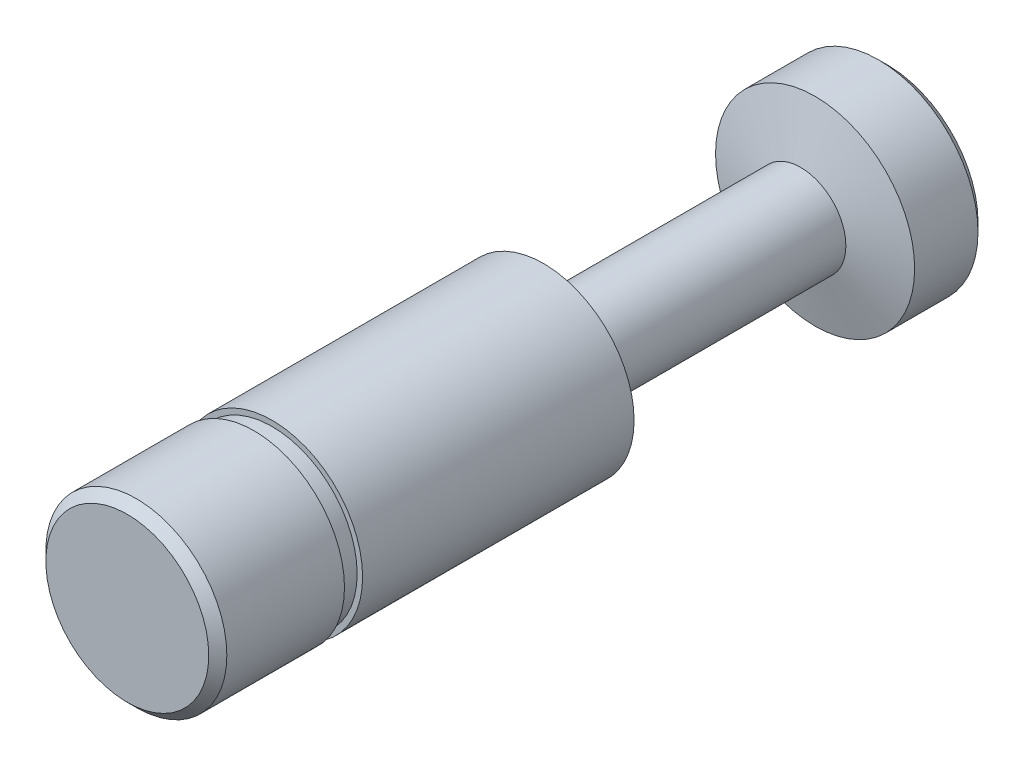
ISO-10303-21;
HEADER;
FILE_DESCRIPTION(('STEP AP214'),'2;1');
FILE_NAME('part.step','',(''),(''),'','','');
FILE_SCHEMA(('AUTOMOTIVE_DESIGN { 1 0 10303 214 1 1 1 1 }'));
ENDSEC;
DATA;
#1=APPLICATION_CONTEXT('core data for automotive mechanical design processes');
#2=APPLICATION_PROTOCOL_DEFINITION('international standard','automotive_design',2000,#1);
#3=PRODUCT_CONTEXT('',#1,'mechanical');
#4=PRODUCT('Part','Part','',(#3));
#5=PRODUCT_RELATED_PRODUCT_CATEGORY('part','',(#4));
#6=PRODUCT_DEFINITION_FORMATION('','',#4);
#7=PRODUCT_DEFINITION_CONTEXT('part definition',#1,'design');
#8=PRODUCT_DEFINITION('design','',#6,#7);
#9=PRODUCT_DEFINITION_SHAPE('','',#8);
#10=(LENGTH_UNIT() NAMED_UNIT(*) SI_UNIT(.MILLI.,.METRE.));
#11=(NAMED_UNIT(*) PLANE_ANGLE_UNIT() SI_UNIT($,.RADIAN.));
#12=(NAMED_UNIT(*) SI_UNIT($,.STERADIAN.) SOLID_ANGLE_UNIT());
#13=UNCERTAINTY_MEASURE_WITH_UNIT(LENGTH_MEASURE(1.E-05),#10,'distance_accuracy_value','');
#14=(GEOMETRIC_REPRESENTATION_CONTEXT(3) GLOBAL_UNCERTAINTY_ASSIGNED_CONTEXT((#13)) GLOBAL_UNIT_ASSIGNED_CONTEXT((#10,
#11,#12)) REPRESENTATION_CONTEXT('',''));
#15=CARTESIAN_POINT('',(0.,0.,0.));
#16=DIRECTION('',(0.,0.,1.));
#17=DIRECTION('',(1.,0.,0.));
#18=AXIS2_PLACEMENT_3D('',#15,#16,#17);
#19=CARTESIAN_POINT('',(0.,0.,-24.44));
#20=DIRECTION('',(0.,0.,1.));
#21=DIRECTION('',(1.,0.,0.));
#22=AXIS2_PLACEMENT_3D('',#19,#20,#21);
#23=CYLINDRICAL_SURFACE('',#22,5.);
#24=CARTESIAN_POINT('',(0.,0.,-23.));
#25=DIRECTION('',(0.,0.,1.));
#26=DIRECTION('',(1.,0.,0.));
#27=AXIS2_PLACEMENT_3D('',#24,#25,#26);
#28=CIRCLE('',#27,5.);
#29=CARTESIAN_POINT('',(5.,0.,-23.));
#30=VERTEX_POINT('',#29);
#31=EDGE_CURVE('E20',#30,#30,#28,.T.);
#32=ORIENTED_EDGE('',*,*,#31,.T.);
#33=EDGE_LOOP('',(#32));
#34=FACE_BOUND('',#33,.T.);
#35=CARTESIAN_POINT('',(0.,0.,-8.));
#36=DIRECTION('',(0.,0.,1.));
#37=DIRECTION('',(1.,0.,0.));
#38=AXIS2_PLACEMENT_3D('',#35,#36,#37);
#39=CIRCLE('',#38,5.);
#40=CARTESIAN_POINT('',(5.,0.,-8.));
#41=VERTEX_POINT('',#40);
#42=EDGE_CURVE('E39',#41,#41,#39,.F.);
#43=ORIENTED_EDGE('',*,*,#42,.T.);
#44=EDGE_LOOP('',(#43));
#45=FACE_BOUND('',#44,.T.);
#46=ADVANCED_FACE('F13',(#34,#45),#23,.T.);
#47=CARTESIAN_POINT('',(0.,0.,-8.));
#48=DIRECTION('',(0.,0.,1.));
#49=DIRECTION('',(1.,0.,0.));
#50=AXIS2_PLACEMENT_3D('',#47,#48,#49);
#51=PLANE('',#50);
#52=ORIENTED_EDGE('',*,*,#42,.F.);
#53=EDGE_LOOP('',(#52));
#54=FACE_BOUND('',#53,.T.);
#55=CARTESIAN_POINT('',(0.,0.,-8.));
#56=DIRECTION('',(0.,0.,1.));
#57=DIRECTION('',(1.,0.,0.));
#58=AXIS2_PLACEMENT_3D('',#55,#56,#57);
#59=CIRCLE('',#58,4.7);
#60=CARTESIAN_POINT('',(4.7,0.,-8.));
#61=VERTEX_POINT('',#60);
#62=EDGE_CURVE('E45',#61,#61,#59,.T.);
#63=ORIENTED_EDGE('',*,*,#62,.F.);
#64=EDGE_LOOP('',(#63));
#65=FACE_BOUND('',#64,.T.);
#66=ADVANCED_FACE('F71',(#54,#65),#51,.T.);
#67=CARTESIAN_POINT('',(0.,0.,-7.));
#68=DIRECTION('',(0.,0.,1.));
#69=DIRECTION('',(1.,0.,0.));
#70=AXIS2_PLACEMENT_3D('',#67,#68,#69);
#71=PLANE('',#70);
#72=CARTESIAN_POINT('',(0.,0.,-7.));
#73=DIRECTION('',(0.,0.,1.));
#74=DIRECTION('',(1.,0.,0.));
#75=AXIS2_PLACEMENT_3D('',#72,#73,#74);
#76=CIRCLE('',#75,5.);
#77=CARTESIAN_POINT('',(5.,0.,-7.));
#78=VERTEX_POINT('',#77);
#79=EDGE_CURVE('E42',#78,#78,#76,.F.);
#80=ORIENTED_EDGE('',*,*,#79,.T.);
#81=EDGE_LOOP('',(#80));
#82=FACE_BOUND('',#81,.T.);
#83=CARTESIAN_POINT('',(0.,0.,-7.));
#84=DIRECTION('',(0.,0.,1.));
#85=DIRECTION('',(1.,0.,0.));
#86=AXIS2_PLACEMENT_3D('',#83,#84,#85);
#87=CIRCLE('',#86,4.7);
#88=CARTESIAN_POINT('',(4.7,0.,-7.));
#89=VERTEX_POINT('',#88);
#90=EDGE_CURVE('E46',#89,#89,#87,.T.);
#91=ORIENTED_EDGE('',*,*,#90,.T.);
#92=EDGE_LOOP('',(#91));
#93=FACE_BOUND('',#92,.T.);
#94=ADVANCED_FACE('F77',(#82,#93),#71,.F.);
#95=CARTESIAN_POINT('',(0.,0.,-8.));
#96=DIRECTION('',(0.,0.,1.));
#97=DIRECTION('',(1.,0.,0.));
#98=AXIS2_PLACEMENT_3D('',#95,#96,#97);
#99=CYLINDRICAL_SURFACE('',#98,4.7);
#100=ORIENTED_EDGE('',*,*,#62,.T.);
#101=EDGE_LOOP('',(#100));
#102=FACE_BOUND('',#101,.T.);
#103=ORIENTED_EDGE('',*,*,#90,.F.);
#104=EDGE_LOOP('',(#103));
#105=FACE_BOUND('',#104,.T.);
#106=ADVANCED_FACE('F92',(#102,#105),#99,.T.);
#107=CARTESIAN_POINT('',(0.,0.,0.));
#108=DIRECTION('',(0.,0.,1.));
#109=DIRECTION('',(1.,0.,0.));
#110=AXIS2_PLACEMENT_3D('',#107,#108,#109);
#111=PLANE('',#110);
#112=CARTESIAN_POINT('',(0.,0.,0.));
#113=DIRECTION('',(0.,0.,1.));
#114=DIRECTION('',(1.,0.,0.));
#115=AXIS2_PLACEMENT_3D('',#112,#113,#114);
#116=CIRCLE('',#115,4.5);
#117=CARTESIAN_POINT('',(4.5,0.,0.));
#118=VERTEX_POINT('',#117);
#119=EDGE_CURVE('E36',#118,#118,#116,.T.);
#120=ORIENTED_EDGE('',*,*,#119,.T.);
#121=EDGE_LOOP('',(#120));
#122=FACE_BOUND('',#121,.T.);
#123=ADVANCED_FACE('F84',(#122),#111,.T.);
#124=CARTESIAN_POINT('',(0.,0.,-0.5));
#125=DIRECTION('',(0.,0.,1.));
#126=DIRECTION('',(1.,0.,0.));
#127=AXIS2_PLACEMENT_3D('',#124,#125,#126);
#128=CIRCLE('',#127,5.);
#129=CARTESIAN_POINT('',(5.,0.,-0.5));
#130=VERTEX_POINT('',#129);
#131=EDGE_CURVE('E33',#130,#130,#128,.F.);
#132=ORIENTED_EDGE('',*,*,#131,.T.);
#133=EDGE_LOOP('',(#132));
#134=FACE_BOUND('',#133,.T.);
#135=ORIENTED_EDGE('',*,*,#79,.F.);
#136=EDGE_LOOP('',(#135));
#137=FACE_BOUND('',#136,.T.);
#138=ADVANCED_FACE('F73',(#134,#137),#23,.T.);
#139=CARTESIAN_POINT('',(0.,0.,-37.2));
#140=DIRECTION('',(0.,0.,1.));
#141=DIRECTION('',(1.,0.,0.));
#142=AXIS2_PLACEMENT_3D('',#139,#140,#141);
#143=CYLINDRICAL_SURFACE('',#142,2.5);
#144=CARTESIAN_POINT('',(0.,0.,-37.2));
#145=DIRECTION('',(0.,0.,1.));
#146=DIRECTION('',(1.,0.,0.));
#147=AXIS2_PLACEMENT_3D('',#144,#145,#146);
#148=CIRCLE('',#147,2.5);
#149=CARTESIAN_POINT('',(2.5,0.,-37.2));
#150=VERTEX_POINT('',#149);
#151=EDGE_CURVE('E49',#150,#150,#148,.T.);
#152=ORIENTED_EDGE('',*,*,#151,.T.);
#153=EDGE_LOOP('',(#152));
#154=FACE_BOUND('',#153,.T.);
#155=CARTESIAN_POINT('',(0.,0.,-24.44));
#156=DIRECTION('',(0.,0.,1.));
#157=DIRECTION('',(1.,0.,0.));
#158=AXIS2_PLACEMENT_3D('',#155,#156,#157);
#159=CIRCLE('',#158,2.5);
#160=CARTESIAN_POINT('',(2.5,0.,-24.44));
#161=VERTEX_POINT('',#160);
#162=EDGE_CURVE('E52',#161,#161,#159,.T.);
#163=ORIENTED_EDGE('',*,*,#162,.F.);
#164=EDGE_LOOP('',(#163));
#165=FACE_BOUND('',#164,.T.);
#166=ADVANCED_FACE('F58',(#154,#165),#143,.T.);
#167=CARTESIAN_POINT('',(0.,0.,-42.));
#168=DIRECTION('',(0.,0.,1.));
#169=DIRECTION('',(1.,0.,0.));
#170=AXIS2_PLACEMENT_3D('',#167,#168,#169);
#171=PLANE('',#170);
#172=CARTESIAN_POINT('',(0.,0.,-42.));
#173=DIRECTION('',(0.,0.,1.));
#174=DIRECTION('',(1.,0.,0.));
#175=AXIS2_PLACEMENT_3D('',#172,#173,#174);
#176=CIRCLE('',#175,4.99999999999997);
#177=CARTESIAN_POINT('',(4.99999999999997,0.,-42.));
#178=VERTEX_POINT('',#177);
#179=EDGE_CURVE('E24',#178,#178,#176,.F.);
#180=ORIENTED_EDGE('',*,*,#179,.T.);
#181=EDGE_LOOP('',(#180));
#182=FACE_BOUND('',#181,.T.);
#183=ADVANCED_FACE('F90',(#182),#171,.F.);
#184=CARTESIAN_POINT('',(0.,0.,-42.));
#185=DIRECTION('',(0.,0.,1.));
#186=DIRECTION('',(1.,0.,0.));
#187=AXIS2_PLACEMENT_3D('',#184,#185,#186);
#188=CYLINDRICAL_SURFACE('',#187,5.5);
#189=CARTESIAN_POINT('',(0.,0.,-38.));
#190=DIRECTION('',(0.,0.,1.));
#191=DIRECTION('',(1.,0.,0.));
#192=AXIS2_PLACEMENT_3D('',#189,#190,#191);
#193=CIRCLE('',#192,5.5);
#194=CARTESIAN_POINT('',(5.5,0.,-38.));
#195=VERTEX_POINT('',#194);
#196=EDGE_CURVE('E9',#195,#195,#193,.F.);
#197=ORIENTED_EDGE('',*,*,#196,.T.);
#198=EDGE_LOOP('',(#197));
#199=FACE_BOUND('',#198,.T.);
#200=CARTESIAN_POINT('',(0.,0.,-41.5));
#201=DIRECTION('',(0.,0.,1.));
#202=DIRECTION('',(1.,0.,0.));
#203=AXIS2_PLACEMENT_3D('',#200,#201,#202);
#204=CIRCLE('',#203,5.5);
#205=CARTESIAN_POINT('',(5.5,0.,-41.5));
#206=VERTEX_POINT('',#205);
#207=EDGE_CURVE('E28',#206,#206,#204,.T.);
#208=ORIENTED_EDGE('',*,*,#207,.T.);
#209=EDGE_LOOP('',(#208));
#210=FACE_BOUND('',#209,.T.);
#211=ADVANCED_FACE('F144',(#199,#210),#188,.T.);
#212=CARTESIAN_POINT('',(0.,0.,0.));
#213=DIRECTION('',(0.,0.,-1.));
#214=DIRECTION('',(-1.,0.,0.));
#215=AXIS2_PLACEMENT_3D('',#212,#213,#214);
#216=CONICAL_SURFACE('',#215,4.5,0.785398163397444);
#217=ORIENTED_EDGE('',*,*,#131,.F.);
#218=EDGE_LOOP('',(#217));
#219=FACE_BOUND('',#218,.T.);
#220=ORIENTED_EDGE('',*,*,#119,.F.);
#221=EDGE_LOOP('',(#220));
#222=FACE_BOUND('',#221,.T.);
#223=ADVANCED_FACE('F154',(#219,#222),#216,.T.);
#224=CARTESIAN_POINT('',(0.,0.,-41.5));
#225=DIRECTION('',(0.,0.,1.));
#226=DIRECTION('',(1.,0.,0.));
#227=AXIS2_PLACEMENT_3D('',#224,#225,#226);
#228=CONICAL_SURFACE('',#227,5.5,0.785398163397447);
#229=ORIENTED_EDGE('',*,*,#179,.F.);
#230=EDGE_LOOP('',(#229));
#231=FACE_BOUND('',#230,.T.);
#232=ORIENTED_EDGE('',*,*,#207,.F.);
#233=EDGE_LOOP('',(#232));
#234=FACE_BOUND('',#233,.T.);
#235=ADVANCED_FACE('F68',(#231,#234),#228,.T.);
#236=CARTESIAN_POINT('',(0.,0.,-24.44));
#237=DIRECTION('',(0.,0.,1.));
#238=DIRECTION('',(1.,0.,0.));
#239=AXIS2_PLACEMENT_3D('',#236,#237,#238);
#240=CONICAL_SURFACE('',#239,2.49999999999999,1.04821084519871);
#241=ORIENTED_EDGE('',*,*,#31,.F.);
#242=EDGE_LOOP('',(#241));
#243=FACE_BOUND('',#242,.T.);
#244=ORIENTED_EDGE('',*,*,#162,.T.);
#245=EDGE_LOOP('',(#244));
#246=FACE_BOUND('',#245,.T.);
#247=ADVANCED_FACE('F62',(#243,#246),#240,.T.);
#248=CARTESIAN_POINT('',(0.,0.,-37.2));
#249=DIRECTION('',(0.,0.,-1.));
#250=DIRECTION('',(-1.,0.,0.));
#251=AXIS2_PLACEMENT_3D('',#248,#249,#250);
#252=CONICAL_SURFACE('',#251,2.49999999999996,1.31019393504756);
#253=ORIENTED_EDGE('',*,*,#196,.F.);
#254=EDGE_LOOP('',(#253));
#255=FACE_BOUND('',#254,.T.);
#256=ORIENTED_EDGE('',*,*,#151,.F.);
#257=EDGE_LOOP('',(#256));
#258=FACE_BOUND('',#257,.T.);
#259=ADVANCED_FACE('F15',(#255,#258),#252,.T.);
#260=CLOSED_SHELL('',(#46,#66,#94,#106,#123,#138,#166,#183,#211,#223,#235,#247,#259));
#261=MANIFOLD_SOLID_BREP('B1',#260);
#262=ADVANCED_BREP_SHAPE_REPRESENTATION('',(#18,#261),#14);
#263=SHAPE_DEFINITION_REPRESENTATION(#9,#262);
ENDSEC;
END-ISO-10303-21;
